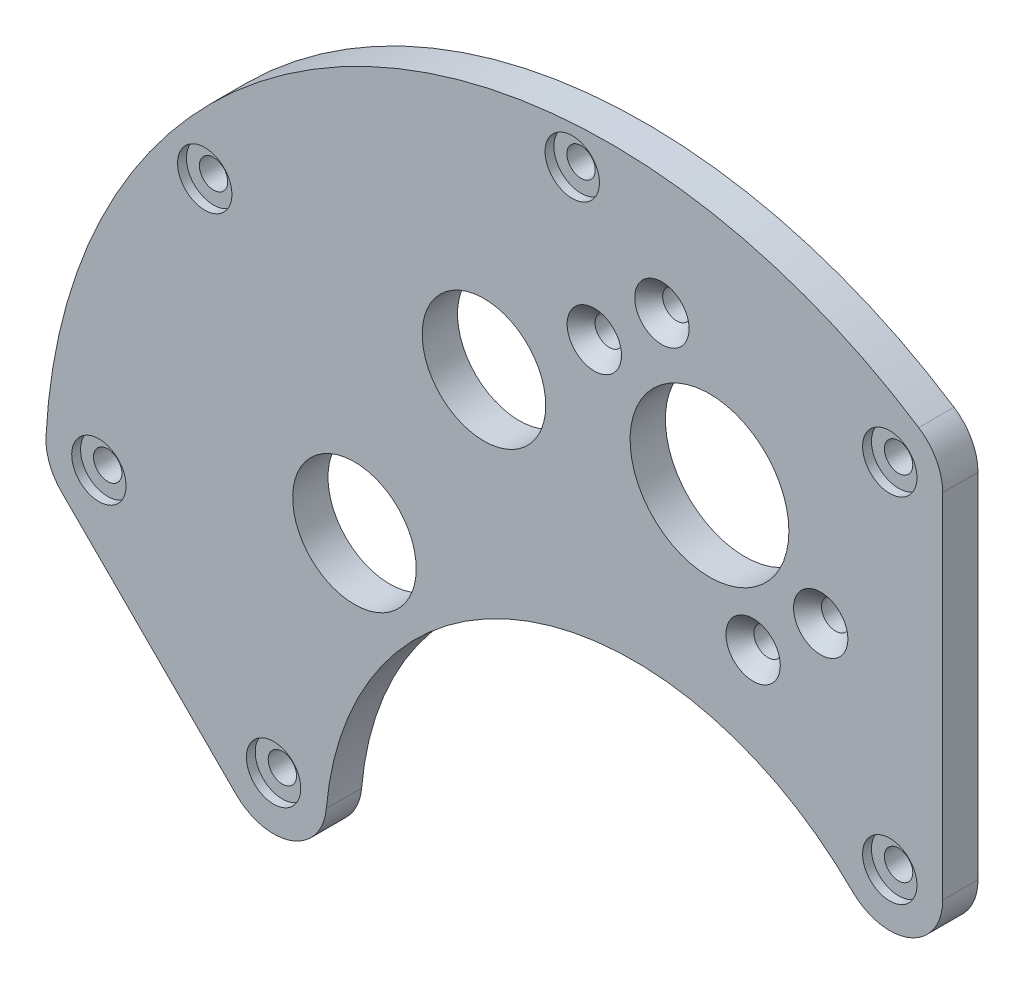
ISO-10303-21;
HEADER;
FILE_DESCRIPTION(('STEP AP214'),'2;1');
FILE_NAME('part.step','',(''),(''),'','','');
FILE_SCHEMA(('AUTOMOTIVE_DESIGN { 1 0 10303 214 1 1 1 1 }'));
ENDSEC;
DATA;
#1=APPLICATION_CONTEXT('core data for automotive mechanical design processes');
#2=APPLICATION_PROTOCOL_DEFINITION('international standard','automotive_design',2000,#1);
#3=PRODUCT_CONTEXT('',#1,'mechanical');
#4=PRODUCT('Part','Part','',(#3));
#5=PRODUCT_RELATED_PRODUCT_CATEGORY('part','',(#4));
#6=PRODUCT_DEFINITION_FORMATION('','',#4);
#7=PRODUCT_DEFINITION_CONTEXT('part definition',#1,'design');
#8=PRODUCT_DEFINITION('design','',#6,#7);
#9=PRODUCT_DEFINITION_SHAPE('','',#8);
#10=(LENGTH_UNIT() NAMED_UNIT(*) SI_UNIT(.MILLI.,.METRE.));
#11=(NAMED_UNIT(*) PLANE_ANGLE_UNIT() SI_UNIT($,.RADIAN.));
#12=(NAMED_UNIT(*) SI_UNIT($,.STERADIAN.) SOLID_ANGLE_UNIT());
#13=UNCERTAINTY_MEASURE_WITH_UNIT(LENGTH_MEASURE(1.E-05),#10,'distance_accuracy_value','');
#14=(GEOMETRIC_REPRESENTATION_CONTEXT(3) GLOBAL_UNCERTAINTY_ASSIGNED_CONTEXT((#13)) GLOBAL_UNIT_ASSIGNED_CONTEXT((#10,
#11,#12)) REPRESENTATION_CONTEXT('',''));
#15=CARTESIAN_POINT('',(0.,0.,0.));
#16=DIRECTION('',(0.,0.,1.));
#17=DIRECTION('',(1.,0.,0.));
#18=AXIS2_PLACEMENT_3D('',#15,#16,#17);
#19=CARTESIAN_POINT('',(46.0238126204794,46.0238126204794,1.5875));
#20=DIRECTION('',(0.,0.,-1.));
#21=DIRECTION('',(-1.,0.,0.));
#22=AXIS2_PLACEMENT_3D('',#19,#20,#21);
#23=PLANE('',#22);
#24=CARTESIAN_POINT('',(46.0238126204794,46.0238126204794,1.5875));
#25=DIRECTION('',(0.,0.,1.));
#26=DIRECTION('',(1.,0.,0.));
#27=AXIS2_PLACEMENT_3D('',#24,#25,#26);
#28=CIRCLE('',#27,4.8895);
#29=CARTESIAN_POINT('',(50.9133126204794,46.0238126204794,1.5875));
#30=VERTEX_POINT('',#29);
#31=EDGE_CURVE('E9',#30,#30,#28,.T.);
#32=ORIENTED_EDGE('',*,*,#31,.T.);
#33=EDGE_LOOP('',(#32));
#34=FACE_BOUND('',#33,.T.);
#35=CARTESIAN_POINT('',(46.0238126204794,46.0238126204794,1.58749999999999));
#36=DIRECTION('',(0.,0.,1.));
#37=DIRECTION('',(1.,0.,0.));
#38=AXIS2_PLACEMENT_3D('',#35,#36,#37);
#39=CIRCLE('',#38,2.5527);
#40=CARTESIAN_POINT('',(48.5765126204794,46.0238126204794,1.58749999999999));
#41=VERTEX_POINT('',#40);
#42=EDGE_CURVE('E25',#41,#41,#39,.T.);
#43=ORIENTED_EDGE('',*,*,#42,.F.);
#44=EDGE_LOOP('',(#43));
#45=FACE_BOUND('',#44,.T.);
#46=ADVANCED_FACE('F15',(#34,#45),#23,.F.);
#47=CARTESIAN_POINT('',(46.0238126204794,46.0238126204794,2.38125));
#48=DIRECTION('',(0.,0.,1.));
#49=DIRECTION('',(1.,0.,0.));
#50=AXIS2_PLACEMENT_3D('',#47,#48,#49);
#51=CYLINDRICAL_SURFACE('',#50,4.8895);
#52=CARTESIAN_POINT('',(46.0238126204794,46.0238126204794,3.175));
#53=DIRECTION('',(0.,0.,-1.));
#54=DIRECTION('',(0.,-1.,0.));
#55=AXIS2_PLACEMENT_3D('',#52,#53,#54);
#56=CIRCLE('',#55,4.8895);
#57=CARTESIAN_POINT('',(46.0238126204794,41.1343126204794,3.175));
#58=VERTEX_POINT('',#57);
#59=EDGE_CURVE('E85',#58,#58,#56,.T.);
#60=ORIENTED_EDGE('',*,*,#59,.F.);
#61=EDGE_LOOP('',(#60));
#62=FACE_BOUND('',#61,.T.);
#63=ORIENTED_EDGE('',*,*,#31,.F.);
#64=EDGE_LOOP('',(#63));
#65=FACE_BOUND('',#64,.T.);
#66=ADVANCED_FACE('F179',(#62,#65),#51,.F.);
#67=CARTESIAN_POINT('',(46.0238126204794,46.0238126204794,-209.94675213111));
#68=DIRECTION('',(0.,0.,1.));
#69=DIRECTION('',(1.,0.,0.));
#70=AXIS2_PLACEMENT_3D('',#67,#68,#69);
#71=CYLINDRICAL_SURFACE('',#70,2.5527);
#72=CARTESIAN_POINT('',(46.0238126204794,46.0238126204794,-3.17499999999999));
#73=DIRECTION('',(0.,0.,1.));
#74=DIRECTION('',(1.,0.,0.));
#75=AXIS2_PLACEMENT_3D('',#72,#73,#74);
#76=CIRCLE('',#75,2.5527);
#77=CARTESIAN_POINT('',(48.5765126204794,46.0238126204794,-3.17499999999999));
#78=VERTEX_POINT('',#77);
#79=EDGE_CURVE('E319',#78,#78,#76,.T.);
#80=ORIENTED_EDGE('',*,*,#79,.F.);
#81=EDGE_LOOP('',(#80));
#82=FACE_BOUND('',#81,.T.);
#83=ORIENTED_EDGE('',*,*,#42,.T.);
#84=EDGE_LOOP('',(#83));
#85=FACE_BOUND('',#84,.T.);
#86=ADVANCED_FACE('F185',(#82,#85),#71,.F.);
#87=CARTESIAN_POINT('',(-64.8398224120465,5.67274940608817,1.5875));
#88=DIRECTION('',(0.,0.,-1.));
#89=DIRECTION('',(-1.,0.,0.));
#90=AXIS2_PLACEMENT_3D('',#87,#88,#89);
#91=PLANE('',#90);
#92=CARTESIAN_POINT('',(-64.8398224120465,5.67274940608817,1.5875));
#93=DIRECTION('',(0.,0.,1.));
#94=DIRECTION('',(1.,0.,0.));
#95=AXIS2_PLACEMENT_3D('',#92,#93,#94);
#96=CIRCLE('',#95,4.8895);
#97=CARTESIAN_POINT('',(-59.9503224120465,5.67274940608817,1.5875));
#98=VERTEX_POINT('',#97);
#99=EDGE_CURVE('E322',#98,#98,#96,.T.);
#100=ORIENTED_EDGE('',*,*,#99,.T.);
#101=EDGE_LOOP('',(#100));
#102=FACE_BOUND('',#101,.T.);
#103=CARTESIAN_POINT('',(-64.8398224120465,5.67274940608817,1.58749999999999));
#104=DIRECTION('',(0.,0.,1.));
#105=DIRECTION('',(1.,0.,0.));
#106=AXIS2_PLACEMENT_3D('',#103,#104,#105);
#107=CIRCLE('',#106,2.5527);
#108=CARTESIAN_POINT('',(-62.2871224120465,5.67274940608817,1.58749999999999));
#109=VERTEX_POINT('',#108);
#110=EDGE_CURVE('E325',#109,#109,#107,.T.);
#111=ORIENTED_EDGE('',*,*,#110,.F.);
#112=EDGE_LOOP('',(#111));
#113=FACE_BOUND('',#112,.T.);
#114=ADVANCED_FACE('F191',(#102,#113),#91,.F.);
#115=CARTESIAN_POINT('',(-64.8398224120465,5.67274940608817,2.38125));
#116=DIRECTION('',(0.,0.,1.));
#117=DIRECTION('',(1.,0.,0.));
#118=AXIS2_PLACEMENT_3D('',#115,#116,#117);
#119=CYLINDRICAL_SURFACE('',#118,4.8895);
#120=CARTESIAN_POINT('',(-64.8398224120465,5.67274940608817,3.175));
#121=DIRECTION('',(0.,0.,-1.));
#122=DIRECTION('',(0.,-1.,0.));
#123=AXIS2_PLACEMENT_3D('',#120,#121,#122);
#124=CIRCLE('',#123,4.8895);
#125=CARTESIAN_POINT('',(-64.8398224120465,0.783249406088172,3.175));
#126=VERTEX_POINT('',#125);
#127=EDGE_CURVE('E330',#126,#126,#124,.T.);
#128=ORIENTED_EDGE('',*,*,#127,.F.);
#129=EDGE_LOOP('',(#128));
#130=FACE_BOUND('',#129,.T.);
#131=ORIENTED_EDGE('',*,*,#99,.F.);
#132=EDGE_LOOP('',(#131));
#133=FACE_BOUND('',#132,.T.);
#134=ADVANCED_FACE('F194',(#130,#133),#119,.F.);
#135=CARTESIAN_POINT('',(-64.8398224120465,5.67274940608817,-209.94675213111));
#136=DIRECTION('',(0.,0.,1.));
#137=DIRECTION('',(1.,0.,0.));
#138=AXIS2_PLACEMENT_3D('',#135,#136,#137);
#139=CYLINDRICAL_SURFACE('',#138,2.5527);
#140=CARTESIAN_POINT('',(-64.8398224120465,5.67274940608817,-3.17499999999999));
#141=DIRECTION('',(0.,0.,1.));
#142=DIRECTION('',(1.,0.,0.));
#143=AXIS2_PLACEMENT_3D('',#140,#141,#142);
#144=CIRCLE('',#143,2.5527);
#145=CARTESIAN_POINT('',(-62.2871224120465,5.67274940608817,-3.17499999999999));
#146=VERTEX_POINT('',#145);
#147=EDGE_CURVE('E332',#146,#146,#144,.T.);
#148=ORIENTED_EDGE('',*,*,#147,.F.);
#149=EDGE_LOOP('',(#148));
#150=FACE_BOUND('',#149,.T.);
#151=ORIENTED_EDGE('',*,*,#110,.T.);
#152=EDGE_LOOP('',(#151));
#153=FACE_BOUND('',#152,.T.);
#154=ADVANCED_FACE('F200',(#150,#153),#139,.F.);
#155=CARTESIAN_POINT('',(-77.2257890029602,92.0341114852002,1.5875));
#156=DIRECTION('',(0.,0.,-1.));
#157=DIRECTION('',(-1.,0.,0.));
#158=AXIS2_PLACEMENT_3D('',#155,#156,#157);
#159=PLANE('',#158);
#160=CARTESIAN_POINT('',(-77.2257890029602,92.0341114852002,1.5875));
#161=DIRECTION('',(0.,0.,1.));
#162=DIRECTION('',(1.,0.,0.));
#163=AXIS2_PLACEMENT_3D('',#160,#161,#162);
#164=CIRCLE('',#163,4.8895);
#165=CARTESIAN_POINT('',(-72.3362890029602,92.0341114852002,1.5875));
#166=VERTEX_POINT('',#165);
#167=EDGE_CURVE('E336',#166,#166,#164,.T.);
#168=ORIENTED_EDGE('',*,*,#167,.T.);
#169=EDGE_LOOP('',(#168));
#170=FACE_BOUND('',#169,.T.);
#171=CARTESIAN_POINT('',(-77.2257890029602,92.0341114852002,1.58749999999999));
#172=DIRECTION('',(0.,0.,1.));
#173=DIRECTION('',(1.,0.,0.));
#174=AXIS2_PLACEMENT_3D('',#171,#172,#173);
#175=CIRCLE('',#174,2.5527);
#176=CARTESIAN_POINT('',(-74.6730890029602,92.0341114852002,1.58749999999999));
#177=VERTEX_POINT('',#176);
#178=EDGE_CURVE('E345',#177,#177,#175,.T.);
#179=ORIENTED_EDGE('',*,*,#178,.F.);
#180=EDGE_LOOP('',(#179));
#181=FACE_BOUND('',#180,.T.);
#182=ADVANCED_FACE('F196',(#170,#181),#159,.F.);
#183=CARTESIAN_POINT('',(-77.2257890029602,92.0341114852002,2.38125));
#184=DIRECTION('',(0.,0.,1.));
#185=DIRECTION('',(1.,0.,0.));
#186=AXIS2_PLACEMENT_3D('',#183,#184,#185);
#187=CYLINDRICAL_SURFACE('',#186,4.8895);
#188=CARTESIAN_POINT('',(-77.2257890029602,92.0341114852002,3.175));
#189=DIRECTION('',(0.,0.,-1.));
#190=DIRECTION('',(0.,-1.,0.));
#191=AXIS2_PLACEMENT_3D('',#188,#189,#190);
#192=CIRCLE('',#191,4.8895);
#193=CARTESIAN_POINT('',(-77.2257890029602,87.1446114852002,3.175));
#194=VERTEX_POINT('',#193);
#195=EDGE_CURVE('E339',#194,#194,#192,.T.);
#196=ORIENTED_EDGE('',*,*,#195,.F.);
#197=EDGE_LOOP('',(#196));
#198=FACE_BOUND('',#197,.T.);
#199=ORIENTED_EDGE('',*,*,#167,.F.);
#200=EDGE_LOOP('',(#199));
#201=FACE_BOUND('',#200,.T.);
#202=ADVANCED_FACE('F199',(#198,#201),#187,.F.);
#203=CARTESIAN_POINT('',(-77.2257890029602,92.0341114852002,-209.94675213111));
#204=DIRECTION('',(0.,0.,1.));
#205=DIRECTION('',(1.,0.,0.));
#206=AXIS2_PLACEMENT_3D('',#203,#204,#205);
#207=CYLINDRICAL_SURFACE('',#206,2.5527);
#208=CARTESIAN_POINT('',(-77.2257890029602,92.0341114852002,-3.17499999999999));
#209=DIRECTION('',(0.,0.,1.));
#210=DIRECTION('',(1.,0.,0.));
#211=AXIS2_PLACEMENT_3D('',#208,#209,#210);
#212=CIRCLE('',#211,2.5527);
#213=CARTESIAN_POINT('',(-74.6730890029602,92.0341114852002,-3.17499999999999));
#214=VERTEX_POINT('',#213);
#215=EDGE_CURVE('E342',#214,#214,#212,.T.);
#216=ORIENTED_EDGE('',*,*,#215,.F.);
#217=EDGE_LOOP('',(#216));
#218=FACE_BOUND('',#217,.T.);
#219=ORIENTED_EDGE('',*,*,#178,.T.);
#220=EDGE_LOOP('',(#219));
#221=FACE_BOUND('',#220,.T.);
#222=ADVANCED_FACE('F206',(#218,#221),#207,.F.);
#223=CARTESIAN_POINT('',(-11.1041994228053,126.921580182956,1.5875));
#224=DIRECTION('',(0.,0.,-1.));
#225=DIRECTION('',(-1.,0.,0.));
#226=AXIS2_PLACEMENT_3D('',#223,#224,#225);
#227=PLANE('',#226);
#228=CARTESIAN_POINT('',(-11.1041994228053,126.921580182956,1.5875));
#229=DIRECTION('',(0.,0.,1.));
#230=DIRECTION('',(1.,0.,0.));
#231=AXIS2_PLACEMENT_3D('',#228,#229,#230);
#232=CIRCLE('',#231,4.8895);
#233=CARTESIAN_POINT('',(-6.21469942280526,126.921580182956,1.5875));
#234=VERTEX_POINT('',#233);
#235=EDGE_CURVE('E348',#234,#234,#232,.T.);
#236=ORIENTED_EDGE('',*,*,#235,.T.);
#237=EDGE_LOOP('',(#236));
#238=FACE_BOUND('',#237,.T.);
#239=CARTESIAN_POINT('',(-11.1041994228053,126.921580182956,1.58749999999999));
#240=DIRECTION('',(0.,0.,1.));
#241=DIRECTION('',(1.,0.,0.));
#242=AXIS2_PLACEMENT_3D('',#239,#240,#241);
#243=CIRCLE('',#242,2.5527);
#244=CARTESIAN_POINT('',(-8.55149942280526,126.921580182956,1.58749999999999));
#245=VERTEX_POINT('',#244);
#246=EDGE_CURVE('E357',#245,#245,#243,.T.);
#247=ORIENTED_EDGE('',*,*,#246,.F.);
#248=EDGE_LOOP('',(#247));
#249=FACE_BOUND('',#248,.T.);
#250=ADVANCED_FACE('F202',(#238,#249),#227,.F.);
#251=CARTESIAN_POINT('',(-11.1041994228053,126.921580182956,2.38125));
#252=DIRECTION('',(0.,0.,1.));
#253=DIRECTION('',(1.,0.,0.));
#254=AXIS2_PLACEMENT_3D('',#251,#252,#253);
#255=CYLINDRICAL_SURFACE('',#254,4.8895);
#256=CARTESIAN_POINT('',(-11.1041994228053,126.921580182956,3.175));
#257=DIRECTION('',(0.,0.,-1.));
#258=DIRECTION('',(0.,-1.,0.));
#259=AXIS2_PLACEMENT_3D('',#256,#257,#258);
#260=CIRCLE('',#259,4.8895);
#261=CARTESIAN_POINT('',(-11.1041994228053,122.032080182956,3.175));
#262=VERTEX_POINT('',#261);
#263=EDGE_CURVE('E351',#262,#262,#260,.T.);
#264=ORIENTED_EDGE('',*,*,#263,.F.);
#265=EDGE_LOOP('',(#264));
#266=FACE_BOUND('',#265,.T.);
#267=ORIENTED_EDGE('',*,*,#235,.F.);
#268=EDGE_LOOP('',(#267));
#269=FACE_BOUND('',#268,.T.);
#270=ADVANCED_FACE('F205',(#266,#269),#255,.F.);
#271=CARTESIAN_POINT('',(-11.1041994228053,126.921580182956,-209.94675213111));
#272=DIRECTION('',(0.,0.,1.));
#273=DIRECTION('',(1.,0.,0.));
#274=AXIS2_PLACEMENT_3D('',#271,#272,#273);
#275=CYLINDRICAL_SURFACE('',#274,2.5527);
#276=CARTESIAN_POINT('',(-11.1041994228053,126.921580182956,-3.17499999999999));
#277=DIRECTION('',(0.,0.,1.));
#278=DIRECTION('',(1.,0.,0.));
#279=AXIS2_PLACEMENT_3D('',#276,#277,#278);
#280=CIRCLE('',#279,2.5527);
#281=CARTESIAN_POINT('',(-8.55149942280526,126.921580182956,-3.17499999999999));
#282=VERTEX_POINT('',#281);
#283=EDGE_CURVE('E354',#282,#282,#280,.T.);
#284=ORIENTED_EDGE('',*,*,#283,.F.);
#285=EDGE_LOOP('',(#284));
#286=FACE_BOUND('',#285,.T.);
#287=ORIENTED_EDGE('',*,*,#246,.T.);
#288=EDGE_LOOP('',(#287));
#289=FACE_BOUND('',#288,.T.);
#290=ADVANCED_FACE('F212',(#286,#289),#275,.F.);
#291=CARTESIAN_POINT('',(46.0238126204794,109.523812620479,1.5875));
#292=DIRECTION('',(0.,0.,-1.));
#293=DIRECTION('',(-1.,0.,0.));
#294=AXIS2_PLACEMENT_3D('',#291,#292,#293);
#295=PLANE('',#294);
#296=CARTESIAN_POINT('',(46.0238126204794,109.523812620479,1.5875));
#297=DIRECTION('',(0.,0.,1.));
#298=DIRECTION('',(1.,0.,0.));
#299=AXIS2_PLACEMENT_3D('',#296,#297,#298);
#300=CIRCLE('',#299,4.8895);
#301=CARTESIAN_POINT('',(50.9133126204794,109.523812620479,1.5875));
#302=VERTEX_POINT('',#301);
#303=EDGE_CURVE('E360',#302,#302,#300,.T.);
#304=ORIENTED_EDGE('',*,*,#303,.T.);
#305=EDGE_LOOP('',(#304));
#306=FACE_BOUND('',#305,.T.);
#307=CARTESIAN_POINT('',(46.0238126204794,109.523812620479,1.58749999999999));
#308=DIRECTION('',(0.,0.,1.));
#309=DIRECTION('',(1.,0.,0.));
#310=AXIS2_PLACEMENT_3D('',#307,#308,#309);
#311=CIRCLE('',#310,2.5527);
#312=CARTESIAN_POINT('',(48.5765126204794,109.523812620479,1.58749999999999));
#313=VERTEX_POINT('',#312);
#314=EDGE_CURVE('E369',#313,#313,#311,.T.);
#315=ORIENTED_EDGE('',*,*,#314,.F.);
#316=EDGE_LOOP('',(#315));
#317=FACE_BOUND('',#316,.T.);
#318=ADVANCED_FACE('F208',(#306,#317),#295,.F.);
#319=CARTESIAN_POINT('',(46.0238126204794,109.523812620479,2.38125));
#320=DIRECTION('',(0.,0.,1.));
#321=DIRECTION('',(1.,0.,0.));
#322=AXIS2_PLACEMENT_3D('',#319,#320,#321);
#323=CYLINDRICAL_SURFACE('',#322,4.8895);
#324=CARTESIAN_POINT('',(46.0238126204794,109.523812620479,3.175));
#325=DIRECTION('',(0.,0.,-1.));
#326=DIRECTION('',(0.,-1.,0.));
#327=AXIS2_PLACEMENT_3D('',#324,#325,#326);
#328=CIRCLE('',#327,4.8895);
#329=CARTESIAN_POINT('',(46.0238126204794,104.634312620479,3.175));
#330=VERTEX_POINT('',#329);
#331=EDGE_CURVE('E363',#330,#330,#328,.T.);
#332=ORIENTED_EDGE('',*,*,#331,.F.);
#333=EDGE_LOOP('',(#332));
#334=FACE_BOUND('',#333,.T.);
#335=ORIENTED_EDGE('',*,*,#303,.F.);
#336=EDGE_LOOP('',(#335));
#337=FACE_BOUND('',#336,.T.);
#338=ADVANCED_FACE('F211',(#334,#337),#323,.F.);
#339=CARTESIAN_POINT('',(46.0238126204794,109.523812620479,-209.94675213111));
#340=DIRECTION('',(0.,0.,1.));
#341=DIRECTION('',(1.,0.,0.));
#342=AXIS2_PLACEMENT_3D('',#339,#340,#341);
#343=CYLINDRICAL_SURFACE('',#342,2.5527);
#344=CARTESIAN_POINT('',(46.0238126204794,109.523812620479,-3.17499999999999));
#345=DIRECTION('',(0.,0.,1.));
#346=DIRECTION('',(1.,0.,0.));
#347=AXIS2_PLACEMENT_3D('',#344,#345,#346);
#348=CIRCLE('',#347,2.5527);
#349=CARTESIAN_POINT('',(48.5765126204794,109.523812620479,-3.17499999999999));
#350=VERTEX_POINT('',#349);
#351=EDGE_CURVE('E366',#350,#350,#348,.T.);
#352=ORIENTED_EDGE('',*,*,#351,.F.);
#353=EDGE_LOOP('',(#352));
#354=FACE_BOUND('',#353,.T.);
#355=ORIENTED_EDGE('',*,*,#314,.T.);
#356=EDGE_LOOP('',(#355));
#357=FACE_BOUND('',#356,.T.);
#358=ADVANCED_FACE('F218',(#354,#357),#343,.F.);
#359=CARTESIAN_POINT('',(-96.2707188357885,37.1036458298302,1.5875));
#360=DIRECTION('',(0.,0.,-1.));
#361=DIRECTION('',(-1.,0.,0.));
#362=AXIS2_PLACEMENT_3D('',#359,#360,#361);
#363=PLANE('',#362);
#364=CARTESIAN_POINT('',(-96.2707188357885,37.1036458298302,1.5875));
#365=DIRECTION('',(0.,0.,1.));
#366=DIRECTION('',(1.,0.,0.));
#367=AXIS2_PLACEMENT_3D('',#364,#365,#366);
#368=CIRCLE('',#367,4.8895);
#369=CARTESIAN_POINT('',(-91.3812188357885,37.1036458298302,1.5875));
#370=VERTEX_POINT('',#369);
#371=EDGE_CURVE('E372',#370,#370,#368,.T.);
#372=ORIENTED_EDGE('',*,*,#371,.T.);
#373=EDGE_LOOP('',(#372));
#374=FACE_BOUND('',#373,.T.);
#375=CARTESIAN_POINT('',(-96.2707188357885,37.1036458298302,1.58749999999999));
#376=DIRECTION('',(0.,0.,1.));
#377=DIRECTION('',(1.,0.,0.));
#378=AXIS2_PLACEMENT_3D('',#375,#376,#377);
#379=CIRCLE('',#378,2.5527);
#380=CARTESIAN_POINT('',(-93.7180188357885,37.1036458298302,1.58749999999999));
#381=VERTEX_POINT('',#380);
#382=EDGE_CURVE('E381',#381,#381,#379,.T.);
#383=ORIENTED_EDGE('',*,*,#382,.F.);
#384=EDGE_LOOP('',(#383));
#385=FACE_BOUND('',#384,.T.);
#386=ADVANCED_FACE('F214',(#374,#385),#363,.F.);
#387=CARTESIAN_POINT('',(-96.2707188357885,37.1036458298302,2.38125));
#388=DIRECTION('',(0.,0.,1.));
#389=DIRECTION('',(1.,0.,0.));
#390=AXIS2_PLACEMENT_3D('',#387,#388,#389);
#391=CYLINDRICAL_SURFACE('',#390,4.8895);
#392=CARTESIAN_POINT('',(-96.2707188357885,37.1036458298302,3.175));
#393=DIRECTION('',(0.,0.,-1.));
#394=DIRECTION('',(0.,-1.,0.));
#395=AXIS2_PLACEMENT_3D('',#392,#393,#394);
#396=CIRCLE('',#395,4.8895);
#397=CARTESIAN_POINT('',(-96.2707188357885,32.2141458298302,3.175));
#398=VERTEX_POINT('',#397);
#399=EDGE_CURVE('E375',#398,#398,#396,.T.);
#400=ORIENTED_EDGE('',*,*,#399,.F.);
#401=EDGE_LOOP('',(#400));
#402=FACE_BOUND('',#401,.T.);
#403=ORIENTED_EDGE('',*,*,#371,.F.);
#404=EDGE_LOOP('',(#403));
#405=FACE_BOUND('',#404,.T.);
#406=ADVANCED_FACE('F217',(#402,#405),#391,.F.);
#407=CARTESIAN_POINT('',(-96.2707188357885,37.1036458298302,-209.94675213111));
#408=DIRECTION('',(0.,0.,1.));
#409=DIRECTION('',(1.,0.,0.));
#410=AXIS2_PLACEMENT_3D('',#407,#408,#409);
#411=CYLINDRICAL_SURFACE('',#410,2.5527);
#412=CARTESIAN_POINT('',(-96.2707188357885,37.1036458298302,-3.17499999999999));
#413=DIRECTION('',(0.,0.,1.));
#414=DIRECTION('',(1.,0.,0.));
#415=AXIS2_PLACEMENT_3D('',#412,#413,#414);
#416=CIRCLE('',#415,2.5527);
#417=CARTESIAN_POINT('',(-93.7180188357885,37.1036458298302,-3.17499999999999));
#418=VERTEX_POINT('',#417);
#419=EDGE_CURVE('E378',#418,#418,#416,.T.);
#420=ORIENTED_EDGE('',*,*,#419,.F.);
#421=EDGE_LOOP('',(#420));
#422=FACE_BOUND('',#421,.T.);
#423=ORIENTED_EDGE('',*,*,#382,.T.);
#424=EDGE_LOOP('',(#423));
#425=FACE_BOUND('',#424,.T.);
#426=ADVANCED_FACE('F280',(#422,#425),#411,.F.);
#427=CARTESIAN_POINT('',(33.5999099064258,78.1657823006196,1.83090955300297));
#428=DIRECTION('',(0.,0.,1.));
#429=DIRECTION('',(1.,0.,0.));
#430=AXIS2_PLACEMENT_3D('',#427,#428,#429);
#431=CONICAL_SURFACE('',#430,3.7211,0.715584993317675);
#432=CARTESIAN_POINT('',(33.5999099064258,78.1657823006196,3.175));
#433=DIRECTION('',(0.,0.,-1.));
#434=DIRECTION('',(0.,-1.,0.));
#435=AXIS2_PLACEMENT_3D('',#432,#433,#434);
#436=CIRCLE('',#435,4.8895);
#437=CARTESIAN_POINT('',(33.5999099064258,73.2762823006196,3.175));
#438=VERTEX_POINT('',#437);
#439=EDGE_CURVE('E387',#438,#438,#436,.T.);
#440=ORIENTED_EDGE('',*,*,#439,.F.);
#441=EDGE_LOOP('',(#440));
#442=FACE_BOUND('',#441,.T.);
#443=CARTESIAN_POINT('',(33.5999099064258,78.1657823006196,0.48681910600597));
#444=DIRECTION('',(0.,0.,1.));
#445=DIRECTION('',(1.,0.,0.));
#446=AXIS2_PLACEMENT_3D('',#443,#444,#445);
#447=CIRCLE('',#446,2.5527);
#448=CARTESIAN_POINT('',(36.1526099064258,78.1657823006196,0.48681910600597));
#449=VERTEX_POINT('',#448);
#450=EDGE_CURVE('E384',#449,#449,#447,.T.);
#451=ORIENTED_EDGE('',*,*,#450,.F.);
#452=EDGE_LOOP('',(#451));
#453=FACE_BOUND('',#452,.T.);
#454=ADVANCED_FACE('F276',(#442,#453),#431,.F.);
#455=CARTESIAN_POINT('',(33.5999099064258,78.1657823006196,-209.15300213111));
#456=DIRECTION('',(0.,0.,1.));
#457=DIRECTION('',(1.,0.,0.));
#458=AXIS2_PLACEMENT_3D('',#455,#456,#457);
#459=CYLINDRICAL_SURFACE('',#458,2.5527);
#460=CARTESIAN_POINT('',(33.5999099064258,78.1657823006196,-3.17499999999999));
#461=DIRECTION('',(0.,0.,1.));
#462=DIRECTION('',(1.,0.,0.));
#463=AXIS2_PLACEMENT_3D('',#460,#461,#462);
#464=CIRCLE('',#463,2.5527);
#465=CARTESIAN_POINT('',(36.1526099064258,78.1657823006196,-3.17499999999999));
#466=VERTEX_POINT('',#465);
#467=EDGE_CURVE('E390',#466,#466,#464,.T.);
#468=ORIENTED_EDGE('',*,*,#467,.F.);
#469=EDGE_LOOP('',(#468));
#470=FACE_BOUND('',#469,.T.);
#471=ORIENTED_EDGE('',*,*,#450,.T.);
#472=EDGE_LOOP('',(#471));
#473=FACE_BOUND('',#472,.T.);
#474=ADVANCED_FACE('F272',(#470,#473),#459,.F.);
#475=CARTESIAN_POINT('',(21.438954371912,67.9615289968458,1.83090955300297));
#476=DIRECTION('',(0.,0.,1.));
#477=DIRECTION('',(1.,0.,0.));
#478=AXIS2_PLACEMENT_3D('',#475,#476,#477);
#479=CONICAL_SURFACE('',#478,3.7211,0.715584993317675);
#480=CARTESIAN_POINT('',(21.438954371912,67.9615289968458,3.175));
#481=DIRECTION('',(0.,0.,-1.));
#482=DIRECTION('',(0.,-1.,0.));
#483=AXIS2_PLACEMENT_3D('',#480,#481,#482);
#484=CIRCLE('',#483,4.8895);
#485=CARTESIAN_POINT('',(21.438954371912,63.0720289968458,3.175));
#486=VERTEX_POINT('',#485);
#487=EDGE_CURVE('E393',#486,#486,#484,.T.);
#488=ORIENTED_EDGE('',*,*,#487,.F.);
#489=EDGE_LOOP('',(#488));
#490=FACE_BOUND('',#489,.T.);
#491=CARTESIAN_POINT('',(21.438954371912,67.9615289968458,0.48681910600597));
#492=DIRECTION('',(0.,0.,1.));
#493=DIRECTION('',(1.,0.,0.));
#494=AXIS2_PLACEMENT_3D('',#491,#492,#493);
#495=CIRCLE('',#494,2.5527);
#496=CARTESIAN_POINT('',(23.991654371912,67.9615289968458,0.48681910600597));
#497=VERTEX_POINT('',#496);
#498=EDGE_CURVE('E396',#497,#497,#495,.T.);
#499=ORIENTED_EDGE('',*,*,#498,.F.);
#500=EDGE_LOOP('',(#499));
#501=FACE_BOUND('',#500,.T.);
#502=ADVANCED_FACE('F268',(#490,#501),#479,.F.);
#503=CARTESIAN_POINT('',(21.438954371912,67.9615289968458,-209.15300213111));
#504=DIRECTION('',(0.,0.,1.));
#505=DIRECTION('',(1.,0.,0.));
#506=AXIS2_PLACEMENT_3D('',#503,#504,#505);
#507=CYLINDRICAL_SURFACE('',#506,2.5527);
#508=CARTESIAN_POINT('',(21.438954371912,67.9615289968458,-3.17499999999999));
#509=DIRECTION('',(0.,0.,1.));
#510=DIRECTION('',(1.,0.,0.));
#511=AXIS2_PLACEMENT_3D('',#508,#509,#510);
#512=CIRCLE('',#511,2.5527);
#513=CARTESIAN_POINT('',(23.991654371912,67.9615289968458,-3.17499999999999));
#514=VERTEX_POINT('',#513);
#515=EDGE_CURVE('E399',#514,#514,#512,.T.);
#516=ORIENTED_EDGE('',*,*,#515,.F.);
#517=EDGE_LOOP('',(#516));
#518=FACE_BOUND('',#517,.T.);
#519=ORIENTED_EDGE('',*,*,#498,.T.);
#520=EDGE_LOOP('',(#519));
#521=FACE_BOUND('',#520,.T.);
#522=ADVANCED_FACE('F264',(#518,#521),#507,.F.);
#523=CARTESIAN_POINT('',(5.02800065585912,112.216457797258,1.83090955300297));
#524=DIRECTION('',(0.,0.,1.));
#525=DIRECTION('',(1.,0.,0.));
#526=AXIS2_PLACEMENT_3D('',#523,#524,#525);
#527=CONICAL_SURFACE('',#526,3.7211,0.715584993317675);
#528=CARTESIAN_POINT('',(5.02800065585912,112.216457797258,3.175));
#529=DIRECTION('',(0.,0.,-1.));
#530=DIRECTION('',(0.,-1.,0.));
#531=AXIS2_PLACEMENT_3D('',#528,#529,#530);
#532=CIRCLE('',#531,4.8895);
#533=CARTESIAN_POINT('',(5.02800065585912,107.326957797258,3.175));
#534=VERTEX_POINT('',#533);
#535=EDGE_CURVE('E402',#534,#534,#532,.T.);
#536=ORIENTED_EDGE('',*,*,#535,.F.);
#537=EDGE_LOOP('',(#536));
#538=FACE_BOUND('',#537,.T.);
#539=CARTESIAN_POINT('',(5.02800065585912,112.216457797258,0.48681910600597));
#540=DIRECTION('',(0.,0.,1.));
#541=DIRECTION('',(1.,0.,0.));
#542=AXIS2_PLACEMENT_3D('',#539,#540,#541);
#543=CIRCLE('',#542,2.5527);
#544=CARTESIAN_POINT('',(7.58070065585912,112.216457797258,0.48681910600597));
#545=VERTEX_POINT('',#544);
#546=EDGE_CURVE('E405',#545,#545,#543,.T.);
#547=ORIENTED_EDGE('',*,*,#546,.F.);
#548=EDGE_LOOP('',(#547));
#549=FACE_BOUND('',#548,.T.);
#550=ADVANCED_FACE('F260',(#538,#549),#527,.F.);
#551=CARTESIAN_POINT('',(5.02800065585912,112.216457797258,-209.15300213111));
#552=DIRECTION('',(0.,0.,1.));
#553=DIRECTION('',(1.,0.,0.));
#554=AXIS2_PLACEMENT_3D('',#551,#552,#553);
#555=CYLINDRICAL_SURFACE('',#554,2.5527);
#556=CARTESIAN_POINT('',(5.02800065585912,112.216457797258,-3.17499999999999));
#557=DIRECTION('',(0.,0.,1.));
#558=DIRECTION('',(1.,0.,0.));
#559=AXIS2_PLACEMENT_3D('',#556,#557,#558);
#560=CIRCLE('',#559,2.5527);
#561=CARTESIAN_POINT('',(7.58070065585912,112.216457797258,-3.17499999999999));
#562=VERTEX_POINT('',#561);
#563=EDGE_CURVE('E408',#562,#562,#560,.T.);
#564=ORIENTED_EDGE('',*,*,#563,.F.);
#565=EDGE_LOOP('',(#564));
#566=FACE_BOUND('',#565,.T.);
#567=ORIENTED_EDGE('',*,*,#546,.T.);
#568=EDGE_LOOP('',(#567));
#569=FACE_BOUND('',#568,.T.);
#570=ADVANCED_FACE('F256',(#566,#569),#555,.F.);
#571=CARTESIAN_POINT('',(-7.13295487865465,102.012204493484,1.83090955300297));
#572=DIRECTION('',(0.,0.,1.));
#573=DIRECTION('',(1.,0.,0.));
#574=AXIS2_PLACEMENT_3D('',#571,#572,#573);
#575=CONICAL_SURFACE('',#574,3.7211,0.715584993317675);
#576=CARTESIAN_POINT('',(-7.13295487865465,102.012204493484,3.175));
#577=DIRECTION('',(0.,0.,-1.));
#578=DIRECTION('',(0.,-1.,0.));
#579=AXIS2_PLACEMENT_3D('',#576,#577,#578);
#580=CIRCLE('',#579,4.8895);
#581=CARTESIAN_POINT('',(-7.13295487865465,97.1227044934844,3.175));
#582=VERTEX_POINT('',#581);
#583=EDGE_CURVE('E411',#582,#582,#580,.T.);
#584=ORIENTED_EDGE('',*,*,#583,.F.);
#585=EDGE_LOOP('',(#584));
#586=FACE_BOUND('',#585,.T.);
#587=CARTESIAN_POINT('',(-7.13295487865465,102.012204493484,0.48681910600597));
#588=DIRECTION('',(0.,0.,1.));
#589=DIRECTION('',(1.,0.,0.));
#590=AXIS2_PLACEMENT_3D('',#587,#588,#589);
#591=CIRCLE('',#590,2.5527);
#592=CARTESIAN_POINT('',(-4.58025487865465,102.012204493484,0.48681910600597));
#593=VERTEX_POINT('',#592);
#594=EDGE_CURVE('E331',#593,#593,#591,.T.);
#595=ORIENTED_EDGE('',*,*,#594,.F.);
#596=EDGE_LOOP('',(#595));
#597=FACE_BOUND('',#596,.T.);
#598=ADVANCED_FACE('F252',(#586,#597),#575,.F.);
#599=CARTESIAN_POINT('',(-7.13295487865465,102.012204493484,-209.15300213111));
#600=DIRECTION('',(0.,0.,1.));
#601=DIRECTION('',(1.,0.,0.));
#602=AXIS2_PLACEMENT_3D('',#599,#600,#601);
#603=CYLINDRICAL_SURFACE('',#602,2.5527);
#604=CARTESIAN_POINT('',(-7.13295487865465,102.012204493484,-3.17499999999999));
#605=DIRECTION('',(0.,0.,1.));
#606=DIRECTION('',(1.,0.,0.));
#607=AXIS2_PLACEMENT_3D('',#604,#605,#606);
#608=CIRCLE('',#607,2.5527);
#609=CARTESIAN_POINT('',(-4.58025487865465,102.012204493484,-3.17499999999999));
#610=VERTEX_POINT('',#609);
#611=EDGE_CURVE('E416',#610,#610,#608,.T.);
#612=ORIENTED_EDGE('',*,*,#611,.F.);
#613=EDGE_LOOP('',(#612));
#614=FACE_BOUND('',#613,.T.);
#615=ORIENTED_EDGE('',*,*,#594,.T.);
#616=EDGE_LOOP('',(#615));
#617=FACE_BOUND('',#616,.T.);
#618=ADVANCED_FACE('F224',(#614,#617),#603,.F.);
#619=CARTESIAN_POINT('',(13.589,89.6652981969771,0.));
#620=DIRECTION('',(0.,0.,1.));
#621=DIRECTION('',(1.,0.,0.));
#622=AXIS2_PLACEMENT_3D('',#619,#620,#621);
#623=CYLINDRICAL_SURFACE('',#622,14.2875);
#624=CARTESIAN_POINT('',(13.589,89.6652981969771,-3.175));
#625=DIRECTION('',(0.,0.,1.));
#626=DIRECTION('',(1.,0.,0.));
#627=AXIS2_PLACEMENT_3D('',#624,#625,#626);
#628=CIRCLE('',#627,14.2875);
#629=CARTESIAN_POINT('',(27.8765,89.6652981969771,-3.175));
#630=VERTEX_POINT('',#629);
#631=EDGE_CURVE('E424',#630,#630,#628,.T.);
#632=ORIENTED_EDGE('',*,*,#631,.F.);
#633=EDGE_LOOP('',(#632));
#634=FACE_BOUND('',#633,.T.);
#635=CARTESIAN_POINT('',(13.589,89.6652981969771,3.175));
#636=DIRECTION('',(0.,0.,-1.));
#637=DIRECTION('',(0.,-1.,0.));
#638=AXIS2_PLACEMENT_3D('',#635,#636,#637);
#639=CIRCLE('',#638,14.2875);
#640=CARTESIAN_POINT('',(13.589,75.3777981969771,3.175));
#641=VERTEX_POINT('',#640);
#642=EDGE_CURVE('E419',#641,#641,#639,.T.);
#643=ORIENTED_EDGE('',*,*,#642,.F.);
#644=EDGE_LOOP('',(#643));
#645=FACE_BOUND('',#644,.T.);
#646=ADVANCED_FACE('F220',(#634,#645),#623,.F.);
#647=CARTESIAN_POINT('',(-26.9875,87.3943407447116,0.));
#648=DIRECTION('',(0.,0.,1.));
#649=DIRECTION('',(1.,0.,0.));
#650=AXIS2_PLACEMENT_3D('',#647,#648,#649);
#651=CYLINDRICAL_SURFACE('',#650,11.1125);
#652=CARTESIAN_POINT('',(-26.9875,87.3943407447116,-3.175));
#653=DIRECTION('',(0.,0.,1.));
#654=DIRECTION('',(1.,0.,0.));
#655=AXIS2_PLACEMENT_3D('',#652,#653,#654);
#656=CIRCLE('',#655,11.1125);
#657=CARTESIAN_POINT('',(-15.875,87.3943407447116,-3.175));
#658=VERTEX_POINT('',#657);
#659=EDGE_CURVE('E142',#658,#658,#656,.T.);
#660=ORIENTED_EDGE('',*,*,#659,.F.);
#661=EDGE_LOOP('',(#660));
#662=FACE_BOUND('',#661,.T.);
#663=CARTESIAN_POINT('',(-26.9875,87.3943407447116,3.175));
#664=DIRECTION('',(0.,0.,-1.));
#665=DIRECTION('',(0.,-1.,0.));
#666=AXIS2_PLACEMENT_3D('',#663,#664,#665);
#667=CIRCLE('',#666,11.1125);
#668=CARTESIAN_POINT('',(-26.9875,76.2818407447116,3.175));
#669=VERTEX_POINT('',#668);
#670=EDGE_CURVE('E429',#669,#669,#667,.T.);
#671=ORIENTED_EDGE('',*,*,#670,.F.);
#672=EDGE_LOOP('',(#671));
#673=FACE_BOUND('',#672,.T.);
#674=ADVANCED_FACE('F223',(#662,#673),#651,.F.);
#675=CARTESIAN_POINT('',(-50.2894342779873,50.2894342779873,0.));
#676=DIRECTION('',(0.,0.,1.));
#677=DIRECTION('',(1.,0.,0.));
#678=AXIS2_PLACEMENT_3D('',#675,#676,#677);
#679=CYLINDRICAL_SURFACE('',#678,11.1125);
#680=CARTESIAN_POINT('',(-50.2894342779873,50.2894342779873,-3.175));
#681=DIRECTION('',(0.,0.,1.));
#682=DIRECTION('',(1.,0.,0.));
#683=AXIS2_PLACEMENT_3D('',#680,#681,#682);
#684=CIRCLE('',#683,11.1125);
#685=CARTESIAN_POINT('',(-39.1769342779873,50.2894342779873,-3.175));
#686=VERTEX_POINT('',#685);
#687=EDGE_CURVE('E138',#686,#686,#684,.T.);
#688=ORIENTED_EDGE('',*,*,#687,.F.);
#689=EDGE_LOOP('',(#688));
#690=FACE_BOUND('',#689,.T.);
#691=CARTESIAN_POINT('',(-50.2894342779873,50.2894342779873,3.175));
#692=DIRECTION('',(0.,0.,-1.));
#693=DIRECTION('',(0.,-1.,0.));
#694=AXIS2_PLACEMENT_3D('',#691,#692,#693);
#695=CIRCLE('',#694,11.1125);
#696=CARTESIAN_POINT('',(-50.2894342779873,39.1769342779873,3.175));
#697=VERTEX_POINT('',#696);
#698=EDGE_CURVE('E433',#697,#697,#695,.T.);
#699=ORIENTED_EDGE('',*,*,#698,.F.);
#700=EDGE_LOOP('',(#699));
#701=FACE_BOUND('',#700,.T.);
#702=ADVANCED_FACE('F226',(#690,#701),#679,.F.);
#703=CARTESIAN_POINT('',(-22.5572287731177,68.8953615141547,-3.175));
#704=DIRECTION('',(0.,0.,1.));
#705=DIRECTION('',(1.,0.,0.));
#706=AXIS2_PLACEMENT_3D('',#703,#704,#705);
#707=PLANE('',#706);
#708=ORIENTED_EDGE('',*,*,#79,.T.);
#709=EDGE_LOOP('',(#708));
#710=FACE_BOUND('',#709,.T.);
#711=ORIENTED_EDGE('',*,*,#147,.T.);
#712=EDGE_LOOP('',(#711));
#713=FACE_BOUND('',#712,.T.);
#714=ORIENTED_EDGE('',*,*,#215,.T.);
#715=EDGE_LOOP('',(#714));
#716=FACE_BOUND('',#715,.T.);
#717=ORIENTED_EDGE('',*,*,#283,.T.);
#718=EDGE_LOOP('',(#717));
#719=FACE_BOUND('',#718,.T.);
#720=ORIENTED_EDGE('',*,*,#351,.T.);
#721=EDGE_LOOP('',(#720));
#722=FACE_BOUND('',#721,.T.);
#723=ORIENTED_EDGE('',*,*,#419,.T.);
#724=EDGE_LOOP('',(#723));
#725=FACE_BOUND('',#724,.T.);
#726=ORIENTED_EDGE('',*,*,#467,.T.);
#727=EDGE_LOOP('',(#726));
#728=FACE_BOUND('',#727,.T.);
#729=ORIENTED_EDGE('',*,*,#515,.T.);
#730=EDGE_LOOP('',(#729));
#731=FACE_BOUND('',#730,.T.);
#732=ORIENTED_EDGE('',*,*,#563,.T.);
#733=EDGE_LOOP('',(#732));
#734=FACE_BOUND('',#733,.T.);
#735=ORIENTED_EDGE('',*,*,#611,.T.);
#736=EDGE_LOOP('',(#735));
#737=FACE_BOUND('',#736,.T.);
#738=ORIENTED_EDGE('',*,*,#631,.T.);
#739=EDGE_LOOP('',(#738));
#740=FACE_BOUND('',#739,.T.);
#741=ORIENTED_EDGE('',*,*,#659,.T.);
#742=EDGE_LOOP('',(#741));
#743=FACE_BOUND('',#742,.T.);
#744=ORIENTED_EDGE('',*,*,#687,.T.);
#745=EDGE_LOOP('',(#744));
#746=FACE_BOUND('',#745,.T.);
#747=CARTESIAN_POINT('',(-4.31454219980161,32.4274076524948,-3.175));
#748=DIRECTION('',(0.,0.,1.));
#749=DIRECTION('',(1.,0.,0.));
#750=AXIS2_PLACEMENT_3D('',#747,#748,#749);
#751=CIRCLE('',#750,101.6);
#752=CARTESIAN_POINT('',(51.2312286363705,117.499302789581,-3.175));
#753=VERTEX_POINT('',#752);
#754=CARTESIAN_POINT('',(-105.783426763649,37.5873946067959,-3.175));
#755=VERTEX_POINT('',#754);
#756=EDGE_CURVE('E91',#753,#755,#751,.T.);
#757=ORIENTED_EDGE('',*,*,#756,.F.);
#758=CARTESIAN_POINT('',(46.0238126204794,109.523812620479,-3.175));
#759=DIRECTION('',(0.,0.,1.));
#760=DIRECTION('',(1.,0.,0.));
#761=AXIS2_PLACEMENT_3D('',#758,#759,#760);
#762=CIRCLE('',#761,9.52499999999992);
#763=CARTESIAN_POINT('',(55.5488126204794,109.523812620479,-3.175));
#764=VERTEX_POINT('',#763);
#765=EDGE_CURVE('E34',#764,#753,#762,.T.);
#766=ORIENTED_EDGE('',*,*,#765,.F.);
#767=DIRECTION('',(0.,1.,0.));
#768=VECTOR('',#767,1.);
#769=CARTESIAN_POINT('',(55.5488126204794,46.0238126204794,-3.175));
#770=LINE('',#769,#768);
#771=CARTESIAN_POINT('',(55.5488126204794,46.0238126204794,-3.175));
#772=VERTEX_POINT('',#771);
#773=EDGE_CURVE('E109',#772,#764,#770,.T.);
#774=ORIENTED_EDGE('',*,*,#773,.F.);
#775=CARTESIAN_POINT('',(46.0238126204794,46.0238126204794,-3.175));
#776=DIRECTION('',(0.,0.,1.));
#777=DIRECTION('',(1.,0.,0.));
#778=AXIS2_PLACEMENT_3D('',#775,#776,#777);
#779=CIRCLE('',#778,9.525);
#780=CARTESIAN_POINT('',(39.2886205296775,39.2886205296776,-3.175));
#781=VERTEX_POINT('',#780);
#782=EDGE_CURVE('E110',#781,#772,#779,.T.);
#783=ORIENTED_EDGE('',*,*,#782,.F.);
#784=CARTESIAN_POINT('',(0.,0.,-3.175));
#785=DIRECTION('',(0.,0.,-1.));
#786=DIRECTION('',(0.,-1.,0.));
#787=AXIS2_PLACEMENT_3D('',#784,#785,#786);
#788=CIRCLE('',#787,55.5625);
#789=CARTESIAN_POINT('',(-55.3510679127226,4.84259095641673,-3.175));
#790=VERTEX_POINT('',#789);
#791=EDGE_CURVE('E113',#790,#781,#788,.T.);
#792=ORIENTED_EDGE('',*,*,#791,.F.);
#793=CARTESIAN_POINT('',(-64.8398224120465,5.67274940608817,-3.175));
#794=DIRECTION('',(0.,0.,1.));
#795=DIRECTION('',(1.,0.,0.));
#796=AXIS2_PLACEMENT_3D('',#793,#794,#795);
#797=CIRCLE('',#796,9.525);
#798=CARTESIAN_POINT('',(-71.5750145028483,-1.06244268471369,-3.175));
#799=VERTEX_POINT('',#798);
#800=EDGE_CURVE('E120',#799,#790,#797,.T.);
#801=ORIENTED_EDGE('',*,*,#800,.F.);
#802=DIRECTION('',(0.707106781186548,-0.707106781186547,0.));
#803=VECTOR('',#802,1.);
#804=CARTESIAN_POINT('',(-103.00591092659,30.3684537390283,-3.175));
#805=LINE('',#804,#803);
#806=CARTESIAN_POINT('',(-103.00591092659,30.3684537390283,-3.175));
#807=VERTEX_POINT('',#806);
#808=EDGE_CURVE('E126',#807,#799,#805,.T.);
#809=ORIENTED_EDGE('',*,*,#808,.F.);
#810=CARTESIAN_POINT('',(-96.2707188357885,37.1036458298302,-3.175));
#811=DIRECTION('',(0.,0.,1.));
#812=DIRECTION('',(1.,0.,0.));
#813=AXIS2_PLACEMENT_3D('',#810,#811,#812);
#814=CIRCLE('',#813,9.5250000000001);
#815=EDGE_CURVE('E131',#755,#807,#814,.T.);
#816=ORIENTED_EDGE('',*,*,#815,.F.);
#817=EDGE_LOOP('',(#757,#766,#774,#783,#792,#801,#809,#816));
#818=FACE_BOUND('',#817,.T.);
#819=ADVANCED_FACE('F158',(#710,#713,#716,#719,#722,#725,#728,#731,#734,#737,#740,#743,#746,
#818),#707,.F.);
#820=CARTESIAN_POINT('',(55.5488126204794,109.523812620479,0.));
#821=DIRECTION('',(1.,0.,0.));
#822=DIRECTION('',(0.,0.,-1.));
#823=AXIS2_PLACEMENT_3D('',#820,#821,#822);
#824=PLANE('',#823);
#825=DIRECTION('',(0.,-1.,0.));
#826=VECTOR('',#825,1.);
#827=CARTESIAN_POINT('',(55.5488126204794,46.0238126204794,3.175));
#828=LINE('',#827,#826);
#829=CARTESIAN_POINT('',(55.5488126204794,109.523812620479,3.175));
#830=VERTEX_POINT('',#829);
#831=CARTESIAN_POINT('',(55.5488126204794,46.0238126204794,3.175));
#832=VERTEX_POINT('',#831);
#833=EDGE_CURVE('E97',#830,#832,#828,.T.);
#834=ORIENTED_EDGE('',*,*,#833,.T.);
#835=DIRECTION('',(0.,0.,1.));
#836=VECTOR('',#835,1.);
#837=CARTESIAN_POINT('',(55.5488126204794,46.0238126204794,0.));
#838=LINE('',#837,#836);
#839=EDGE_CURVE('E104',#772,#832,#838,.T.);
#840=ORIENTED_EDGE('',*,*,#839,.F.);
#841=ORIENTED_EDGE('',*,*,#773,.T.);
#842=DIRECTION('',(0.,0.,-1.));
#843=VECTOR('',#842,1.);
#844=CARTESIAN_POINT('',(55.5488126204794,109.523812620479,0.));
#845=LINE('',#844,#843);
#846=EDGE_CURVE('E98',#830,#764,#845,.T.);
#847=ORIENTED_EDGE('',*,*,#846,.F.);
#848=EDGE_LOOP('',(#834,#840,#841,#847));
#849=FACE_BOUND('',#848,.T.);
#850=ADVANCED_FACE('F238',(#849),#824,.T.);
#851=CARTESIAN_POINT('',(46.0238126204794,46.0238126204794,0.));
#852=DIRECTION('',(0.,0.,1.));
#853=DIRECTION('',(1.,0.,0.));
#854=AXIS2_PLACEMENT_3D('',#851,#852,#853);
#855=CYLINDRICAL_SURFACE('',#854,9.525);
#856=CARTESIAN_POINT('',(46.0238126204794,46.0238126204794,3.175));
#857=DIRECTION('',(0.,0.,-1.));
#858=DIRECTION('',(0.,-1.,0.));
#859=AXIS2_PLACEMENT_3D('',#856,#857,#858);
#860=CIRCLE('',#859,9.525);
#861=CARTESIAN_POINT('',(39.2886205296775,39.2886205296776,3.175));
#862=VERTEX_POINT('',#861);
#863=EDGE_CURVE('E106',#832,#862,#860,.T.);
#864=ORIENTED_EDGE('',*,*,#863,.T.);
#865=DIRECTION('',(0.,0.,1.));
#866=VECTOR('',#865,1.);
#867=CARTESIAN_POINT('',(39.2886205296775,39.2886205296776,0.));
#868=LINE('',#867,#866);
#869=EDGE_CURVE('E111',#781,#862,#868,.T.);
#870=ORIENTED_EDGE('',*,*,#869,.F.);
#871=ORIENTED_EDGE('',*,*,#782,.T.);
#872=ORIENTED_EDGE('',*,*,#839,.T.);
#873=EDGE_LOOP('',(#864,#870,#871,#872));
#874=FACE_BOUND('',#873,.T.);
#875=ADVANCED_FACE('F235',(#874),#855,.T.);
#876=CARTESIAN_POINT('',(0.,0.,0.));
#877=DIRECTION('',(0.,0.,1.));
#878=DIRECTION('',(1.,0.,0.));
#879=AXIS2_PLACEMENT_3D('',#876,#877,#878);
#880=CYLINDRICAL_SURFACE('',#879,55.5625);
#881=CARTESIAN_POINT('',(0.,0.,3.175));
#882=DIRECTION('',(0.,0.,1.));
#883=DIRECTION('',(1.,0.,0.));
#884=AXIS2_PLACEMENT_3D('',#881,#882,#883);
#885=CIRCLE('',#884,55.5625);
#886=CARTESIAN_POINT('',(-55.3510679127226,4.84259095641673,3.175));
#887=VERTEX_POINT('',#886);
#888=EDGE_CURVE('E115',#862,#887,#885,.T.);
#889=ORIENTED_EDGE('',*,*,#888,.T.);
#890=DIRECTION('',(0.,0.,1.));
#891=VECTOR('',#890,1.);
#892=CARTESIAN_POINT('',(-55.3510679127226,4.84259095641673,0.));
#893=LINE('',#892,#891);
#894=EDGE_CURVE('E118',#790,#887,#893,.T.);
#895=ORIENTED_EDGE('',*,*,#894,.F.);
#896=ORIENTED_EDGE('',*,*,#791,.T.);
#897=ORIENTED_EDGE('',*,*,#869,.T.);
#898=EDGE_LOOP('',(#889,#895,#896,#897));
#899=FACE_BOUND('',#898,.T.);
#900=ADVANCED_FACE('F161',(#899),#880,.F.);
#901=CARTESIAN_POINT('',(-64.8398224120465,5.67274940608817,0.));
#902=DIRECTION('',(0.,0.,1.));
#903=DIRECTION('',(1.,0.,0.));
#904=AXIS2_PLACEMENT_3D('',#901,#902,#903);
#905=CYLINDRICAL_SURFACE('',#904,9.525);
#906=CARTESIAN_POINT('',(-64.8398224120465,5.67274940608817,3.175));
#907=DIRECTION('',(0.,0.,-1.));
#908=DIRECTION('',(0.,-1.,0.));
#909=AXIS2_PLACEMENT_3D('',#906,#907,#908);
#910=CIRCLE('',#909,9.525);
#911=CARTESIAN_POINT('',(-71.5750145028483,-1.06244268471369,3.175));
#912=VERTEX_POINT('',#911);
#913=EDGE_CURVE('E114',#887,#912,#910,.T.);
#914=ORIENTED_EDGE('',*,*,#913,.T.);
#915=DIRECTION('',(0.,0.,1.));
#916=VECTOR('',#915,1.);
#917=CARTESIAN_POINT('',(-71.5750145028483,-1.06244268471369,0.));
#918=LINE('',#917,#916);
#919=EDGE_CURVE('E124',#799,#912,#918,.T.);
#920=ORIENTED_EDGE('',*,*,#919,.F.);
#921=ORIENTED_EDGE('',*,*,#800,.T.);
#922=ORIENTED_EDGE('',*,*,#894,.T.);
#923=EDGE_LOOP('',(#914,#920,#921,#922));
#924=FACE_BOUND('',#923,.T.);
#925=ADVANCED_FACE('F154',(#924),#905,.T.);
#926=CARTESIAN_POINT('',(-71.5750145028483,-1.06244268471369,0.));
#927=DIRECTION('',(-0.707106781186547,-0.707106781186548,0.));
#928=DIRECTION('',(0.707106781186548,-0.707106781186547,0.));
#929=AXIS2_PLACEMENT_3D('',#926,#927,#928);
#930=PLANE('',#929);
#931=DIRECTION('',(-0.707106781186548,0.707106781186547,0.));
#932=VECTOR('',#931,1.);
#933=CARTESIAN_POINT('',(-103.00591092659,30.3684537390283,3.175));
#934=LINE('',#933,#932);
#935=CARTESIAN_POINT('',(-103.00591092659,30.3684537390283,3.175));
#936=VERTEX_POINT('',#935);
#937=EDGE_CURVE('E121',#912,#936,#934,.T.);
#938=ORIENTED_EDGE('',*,*,#937,.T.);
#939=DIRECTION('',(0.,0.,1.));
#940=VECTOR('',#939,1.);
#941=CARTESIAN_POINT('',(-103.00591092659,30.3684537390283,0.));
#942=LINE('',#941,#940);
#943=EDGE_CURVE('E90',#807,#936,#942,.T.);
#944=ORIENTED_EDGE('',*,*,#943,.F.);
#945=ORIENTED_EDGE('',*,*,#808,.T.);
#946=ORIENTED_EDGE('',*,*,#919,.T.);
#947=EDGE_LOOP('',(#938,#944,#945,#946));
#948=FACE_BOUND('',#947,.T.);
#949=ADVANCED_FACE('F167',(#948),#930,.T.);
#950=CARTESIAN_POINT('',(-96.2707188357885,37.1036458298302,0.));
#951=DIRECTION('',(0.,0.,1.));
#952=DIRECTION('',(1.,0.,0.));
#953=AXIS2_PLACEMENT_3D('',#950,#951,#952);
#954=CYLINDRICAL_SURFACE('',#953,9.5250000000001);
#955=CARTESIAN_POINT('',(-96.2707188357885,37.1036458298302,3.175));
#956=DIRECTION('',(0.,0.,-1.));
#957=DIRECTION('',(0.,-1.,0.));
#958=AXIS2_PLACEMENT_3D('',#955,#956,#957);
#959=CIRCLE('',#958,9.5250000000001);
#960=CARTESIAN_POINT('',(-105.783426763649,37.5873946067959,3.175));
#961=VERTEX_POINT('',#960);
#962=EDGE_CURVE('E127',#936,#961,#959,.T.);
#963=ORIENTED_EDGE('',*,*,#962,.T.);
#964=DIRECTION('',(0.,0.,1.));
#965=VECTOR('',#964,1.);
#966=CARTESIAN_POINT('',(-105.783426763649,37.5873946067959,0.));
#967=LINE('',#966,#965);
#968=EDGE_CURVE('E78',#755,#961,#967,.T.);
#969=ORIENTED_EDGE('',*,*,#968,.F.);
#970=ORIENTED_EDGE('',*,*,#815,.T.);
#971=ORIENTED_EDGE('',*,*,#943,.T.);
#972=EDGE_LOOP('',(#963,#969,#970,#971));
#973=FACE_BOUND('',#972,.T.);
#974=ADVANCED_FACE('F168',(#973),#954,.T.);
#975=CARTESIAN_POINT('',(-4.31454219980161,32.4274076524948,0.));
#976=DIRECTION('',(0.,0.,1.));
#977=DIRECTION('',(1.,0.,0.));
#978=AXIS2_PLACEMENT_3D('',#975,#976,#977);
#979=CYLINDRICAL_SURFACE('',#978,101.6);
#980=CARTESIAN_POINT('',(-4.31454219980161,32.4274076524948,3.175));
#981=DIRECTION('',(0.,0.,-1.));
#982=DIRECTION('',(0.,-1.,0.));
#983=AXIS2_PLACEMENT_3D('',#980,#981,#982);
#984=CIRCLE('',#983,101.6);
#985=CARTESIAN_POINT('',(51.2312286363705,117.499302789581,3.175));
#986=VERTEX_POINT('',#985);
#987=EDGE_CURVE('E87',#961,#986,#984,.T.);
#988=ORIENTED_EDGE('',*,*,#987,.T.);
#989=DIRECTION('',(0.,0.,1.));
#990=VECTOR('',#989,1.);
#991=CARTESIAN_POINT('',(51.2312286363705,117.499302789581,0.));
#992=LINE('',#991,#990);
#993=EDGE_CURVE('E82',#753,#986,#992,.T.);
#994=ORIENTED_EDGE('',*,*,#993,.F.);
#995=ORIENTED_EDGE('',*,*,#756,.T.);
#996=ORIENTED_EDGE('',*,*,#968,.T.);
#997=EDGE_LOOP('',(#988,#994,#995,#996));
#998=FACE_BOUND('',#997,.T.);
#999=ADVANCED_FACE('F17',(#998),#979,.T.);
#1000=CARTESIAN_POINT('',(46.0238126204794,109.523812620479,0.));
#1001=DIRECTION('',(0.,0.,1.));
#1002=DIRECTION('',(1.,0.,0.));
#1003=AXIS2_PLACEMENT_3D('',#1000,#1001,#1002);
#1004=CYLINDRICAL_SURFACE('',#1003,9.52499999999992);
#1005=CARTESIAN_POINT('',(46.0238126204794,109.523812620479,3.175));
#1006=DIRECTION('',(0.,0.,-1.));
#1007=DIRECTION('',(0.,-1.,0.));
#1008=AXIS2_PLACEMENT_3D('',#1005,#1006,#1007);
#1009=CIRCLE('',#1008,9.52499999999992);
#1010=EDGE_CURVE('E19',#986,#830,#1009,.T.);
#1011=ORIENTED_EDGE('',*,*,#1010,.T.);
#1012=ORIENTED_EDGE('',*,*,#846,.T.);
#1013=ORIENTED_EDGE('',*,*,#765,.T.);
#1014=ORIENTED_EDGE('',*,*,#993,.T.);
#1015=EDGE_LOOP('',(#1011,#1012,#1013,#1014));
#1016=FACE_BOUND('',#1015,.T.);
#1017=ADVANCED_FACE('F83',(#1016),#1004,.T.);
#1018=CARTESIAN_POINT('',(-22.5572287731177,68.8953615141547,3.175));
#1019=DIRECTION('',(0.,0.,1.));
#1020=DIRECTION('',(1.,0.,0.));
#1021=AXIS2_PLACEMENT_3D('',#1018,#1019,#1020);
#1022=PLANE('',#1021);
#1023=ORIENTED_EDGE('',*,*,#59,.T.);
#1024=EDGE_LOOP('',(#1023));
#1025=FACE_BOUND('',#1024,.T.);
#1026=ORIENTED_EDGE('',*,*,#127,.T.);
#1027=EDGE_LOOP('',(#1026));
#1028=FACE_BOUND('',#1027,.T.);
#1029=ORIENTED_EDGE('',*,*,#195,.T.);
#1030=EDGE_LOOP('',(#1029));
#1031=FACE_BOUND('',#1030,.T.);
#1032=ORIENTED_EDGE('',*,*,#263,.T.);
#1033=EDGE_LOOP('',(#1032));
#1034=FACE_BOUND('',#1033,.T.);
#1035=ORIENTED_EDGE('',*,*,#331,.T.);
#1036=EDGE_LOOP('',(#1035));
#1037=FACE_BOUND('',#1036,.T.);
#1038=ORIENTED_EDGE('',*,*,#399,.T.);
#1039=EDGE_LOOP('',(#1038));
#1040=FACE_BOUND('',#1039,.T.);
#1041=ORIENTED_EDGE('',*,*,#439,.T.);
#1042=EDGE_LOOP('',(#1041));
#1043=FACE_BOUND('',#1042,.T.);
#1044=ORIENTED_EDGE('',*,*,#487,.T.);
#1045=EDGE_LOOP('',(#1044));
#1046=FACE_BOUND('',#1045,.T.);
#1047=ORIENTED_EDGE('',*,*,#535,.T.);
#1048=EDGE_LOOP('',(#1047));
#1049=FACE_BOUND('',#1048,.T.);
#1050=ORIENTED_EDGE('',*,*,#583,.T.);
#1051=EDGE_LOOP('',(#1050));
#1052=FACE_BOUND('',#1051,.T.);
#1053=ORIENTED_EDGE('',*,*,#642,.T.);
#1054=EDGE_LOOP('',(#1053));
#1055=FACE_BOUND('',#1054,.T.);
#1056=ORIENTED_EDGE('',*,*,#670,.T.);
#1057=EDGE_LOOP('',(#1056));
#1058=FACE_BOUND('',#1057,.T.);
#1059=ORIENTED_EDGE('',*,*,#698,.T.);
#1060=EDGE_LOOP('',(#1059));
#1061=FACE_BOUND('',#1060,.T.);
#1062=ORIENTED_EDGE('',*,*,#833,.F.);
#1063=ORIENTED_EDGE('',*,*,#1010,.F.);
#1064=ORIENTED_EDGE('',*,*,#987,.F.);
#1065=ORIENTED_EDGE('',*,*,#962,.F.);
#1066=ORIENTED_EDGE('',*,*,#937,.F.);
#1067=ORIENTED_EDGE('',*,*,#913,.F.);
#1068=ORIENTED_EDGE('',*,*,#888,.F.);
#1069=ORIENTED_EDGE('',*,*,#863,.F.);
#1070=EDGE_LOOP('',(#1062,#1063,#1064,#1065,#1066,#1067,#1068,#1069));
#1071=FACE_BOUND('',#1070,.T.);
#1072=ADVANCED_FACE('F94',(#1025,#1028,#1031,#1034,#1037,#1040,#1043,#1046,#1049,#1052,#1055,
#1058,#1061,#1071),#1022,.T.);
#1073=CLOSED_SHELL('',(#46,#66,#86,#114,#134,#154,#182,#202,#222,#250,#270,#290,#318,#338,#358,
#386,#406,#426,#454,#474,#502,#522,#550,#570,#598,#618,#646,#674,#702,#819,#850,#875,#900,#925,
#949,#974,#999,#1017,#1072));
#1074=MANIFOLD_SOLID_BREP('B1',#1073);
#1075=ADVANCED_BREP_SHAPE_REPRESENTATION('',(#18,#1074),#14);
#1076=SHAPE_DEFINITION_REPRESENTATION(#9,#1075);
ENDSEC;
END-ISO-10303-21;
